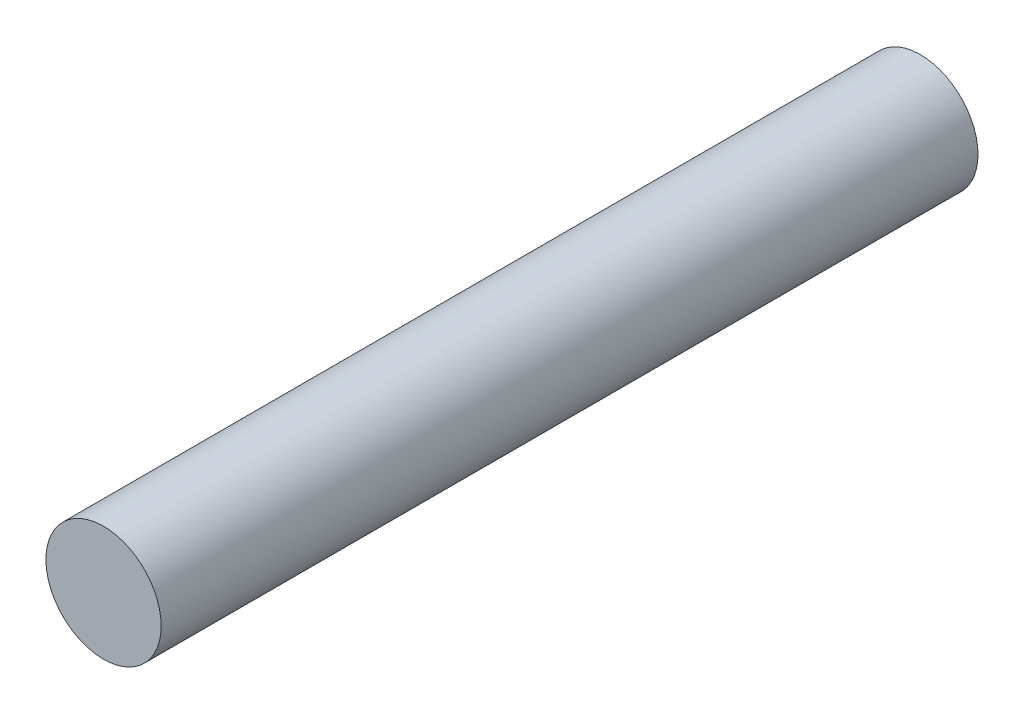
ISO-10303-21;
HEADER;
FILE_DESCRIPTION(('STEP AP214'),'2;1');
FILE_NAME('part.step','',(''),(''),'','','');
FILE_SCHEMA(('AUTOMOTIVE_DESIGN { 1 0 10303 214 1 1 1 1 }'));
ENDSEC;
DATA;
#1=APPLICATION_CONTEXT('core data for automotive mechanical design processes');
#2=APPLICATION_PROTOCOL_DEFINITION('international standard','automotive_design',2000,#1);
#3=PRODUCT_CONTEXT('',#1,'mechanical');
#4=PRODUCT('Part','Part','',(#3));
#5=PRODUCT_RELATED_PRODUCT_CATEGORY('part','',(#4));
#6=PRODUCT_DEFINITION_FORMATION('','',#4);
#7=PRODUCT_DEFINITION_CONTEXT('part definition',#1,'design');
#8=PRODUCT_DEFINITION('design','',#6,#7);
#9=PRODUCT_DEFINITION_SHAPE('','',#8);
#10=(LENGTH_UNIT() NAMED_UNIT(*) SI_UNIT(.MILLI.,.METRE.));
#11=(NAMED_UNIT(*) PLANE_ANGLE_UNIT() SI_UNIT($,.RADIAN.));
#12=(NAMED_UNIT(*) SI_UNIT($,.STERADIAN.) SOLID_ANGLE_UNIT());
#13=UNCERTAINTY_MEASURE_WITH_UNIT(LENGTH_MEASURE(1.E-05),#10,'distance_accuracy_value','');
#14=(GEOMETRIC_REPRESENTATION_CONTEXT(3) GLOBAL_UNCERTAINTY_ASSIGNED_CONTEXT((#13)) GLOBAL_UNIT_ASSIGNED_CONTEXT((#10,
#11,#12)) REPRESENTATION_CONTEXT('',''));
#15=CARTESIAN_POINT('',(0.,0.,0.));
#16=DIRECTION('',(0.,0.,1.));
#17=DIRECTION('',(1.,0.,0.));
#18=AXIS2_PLACEMENT_3D('',#15,#16,#17);
#19=CARTESIAN_POINT('',(0.,0.,45.));
#20=DIRECTION('',(0.,0.,-1.));
#21=DIRECTION('',(-1.,0.,0.));
#22=AXIS2_PLACEMENT_3D('',#19,#20,#21);
#23=CYLINDRICAL_SURFACE('',#22,3.175);
#24=CARTESIAN_POINT('',(0.,0.,45.));
#25=DIRECTION('',(0.,0.,1.));
#26=DIRECTION('',(1.,0.,0.));
#27=AXIS2_PLACEMENT_3D('',#24,#25,#26);
#28=CIRCLE('',#27,3.175);
#29=CARTESIAN_POINT('',(3.175,0.,45.));
#30=VERTEX_POINT('',#29);
#31=EDGE_CURVE('E10',#30,#30,#28,.T.);
#32=ORIENTED_EDGE('',*,*,#31,.F.);
#33=EDGE_LOOP('',(#32));
#34=FACE_BOUND('',#33,.T.);
#35=CARTESIAN_POINT('',(0.,0.,0.));
#36=DIRECTION('',(0.,0.,1.));
#37=DIRECTION('',(1.,0.,0.));
#38=AXIS2_PLACEMENT_3D('',#35,#36,#37);
#39=CIRCLE('',#38,3.175);
#40=CARTESIAN_POINT('',(3.175,0.,0.));
#41=VERTEX_POINT('',#40);
#42=EDGE_CURVE('E34',#41,#41,#39,.T.);
#43=ORIENTED_EDGE('',*,*,#42,.T.);
#44=EDGE_LOOP('',(#43));
#45=FACE_BOUND('',#44,.T.);
#46=ADVANCED_FACE('F31',(#34,#45),#23,.T.);
#47=CARTESIAN_POINT('',(0.,0.,45.));
#48=DIRECTION('',(0.,0.,1.));
#49=DIRECTION('',(1.,0.,0.));
#50=AXIS2_PLACEMENT_3D('',#47,#48,#49);
#51=PLANE('',#50);
#52=ORIENTED_EDGE('',*,*,#31,.T.);
#53=EDGE_LOOP('',(#52));
#54=FACE_BOUND('',#53,.T.);
#55=ADVANCED_FACE('F46',(#54),#51,.T.);
#56=CARTESIAN_POINT('',(0.,0.,0.));
#57=DIRECTION('',(0.,0.,1.));
#58=DIRECTION('',(1.,0.,0.));
#59=AXIS2_PLACEMENT_3D('',#56,#57,#58);
#60=PLANE('',#59);
#61=ORIENTED_EDGE('',*,*,#42,.F.);
#62=EDGE_LOOP('',(#61));
#63=FACE_BOUND('',#62,.T.);
#64=ADVANCED_FACE('F44',(#63),#60,.F.);
#65=CLOSED_SHELL('',(#46,#55,#64));
#66=MANIFOLD_SOLID_BREP('B2',#65);
#67=ADVANCED_BREP_SHAPE_REPRESENTATION('',(#18,#66),#14);
#68=SHAPE_DEFINITION_REPRESENTATION(#9,#67);
ENDSEC;
END-ISO-10303-21;
